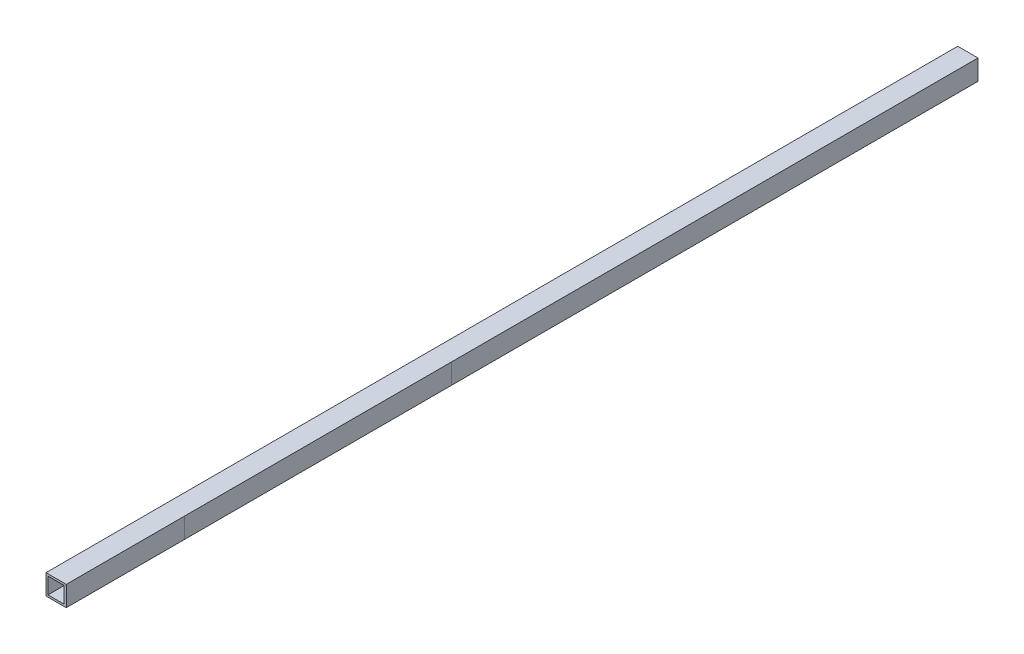
ISO-10303-21;
HEADER;
FILE_DESCRIPTION(('STEP AP214'),'2;1');
FILE_NAME('part.step','',(''),(''),'','','');
FILE_SCHEMA(('AUTOMOTIVE_DESIGN { 1 0 10303 214 1 1 1 1 }'));
ENDSEC;
DATA;
#1=APPLICATION_CONTEXT('core data for automotive mechanical design processes');
#2=APPLICATION_PROTOCOL_DEFINITION('international standard','automotive_design',2000,#1);
#3=PRODUCT_CONTEXT('',#1,'mechanical');
#4=PRODUCT('Part','Part','',(#3));
#5=PRODUCT_RELATED_PRODUCT_CATEGORY('part','',(#4));
#6=PRODUCT_DEFINITION_FORMATION('','',#4);
#7=PRODUCT_DEFINITION_CONTEXT('part definition',#1,'design');
#8=PRODUCT_DEFINITION('design','',#6,#7);
#9=PRODUCT_DEFINITION_SHAPE('','',#8);
#10=(LENGTH_UNIT() NAMED_UNIT(*) SI_UNIT(.MILLI.,.METRE.));
#11=(NAMED_UNIT(*) PLANE_ANGLE_UNIT() SI_UNIT($,.RADIAN.));
#12=(NAMED_UNIT(*) SI_UNIT($,.STERADIAN.) SOLID_ANGLE_UNIT());
#13=UNCERTAINTY_MEASURE_WITH_UNIT(LENGTH_MEASURE(1.E-05),#10,'distance_accuracy_value','');
#14=(GEOMETRIC_REPRESENTATION_CONTEXT(3) GLOBAL_UNCERTAINTY_ASSIGNED_CONTEXT((#13)) GLOBAL_UNIT_ASSIGNED_CONTEXT((#10,
#11,#12)) REPRESENTATION_CONTEXT('',''));
#15=CARTESIAN_POINT('',(0.,0.,0.));
#16=DIRECTION('',(0.,0.,1.));
#17=DIRECTION('',(1.,0.,0.));
#18=AXIS2_PLACEMENT_3D('',#15,#16,#17);
#19=CARTESIAN_POINT('',(40.,0.,-1800.));
#20=DIRECTION('',(1.,0.,0.));
#21=DIRECTION('',(0.,1.,0.));
#22=AXIS2_PLACEMENT_3D('',#19,#20,#21);
#23=PLANE('',#22);
#24=DIRECTION('',(0.,0.,1.));
#25=VECTOR('',#24,1.);
#26=CARTESIAN_POINT('',(40.,0.,-1800.));
#27=LINE('',#26,#25);
#28=CARTESIAN_POINT('',(40.,0.,-233.430525183103));
#29=VERTEX_POINT('',#28);
#30=CARTESIAN_POINT('',(40.,0.,0.));
#31=VERTEX_POINT('',#30);
#32=EDGE_CURVE('E193',#29,#31,#27,.T.);
#33=ORIENTED_EDGE('',*,*,#32,.F.);
#34=DIRECTION('',(0.,1.,0.));
#35=VECTOR('',#34,1.);
#36=CARTESIAN_POINT('',(40.,0.,-233.430525183103));
#37=LINE('',#36,#35);
#38=CARTESIAN_POINT('',(40.,40.,-233.430525183103));
#39=VERTEX_POINT('',#38);
#40=EDGE_CURVE('E11',#29,#39,#37,.T.);
#41=ORIENTED_EDGE('',*,*,#40,.T.);
#42=DIRECTION('',(0.,0.,1.));
#43=VECTOR('',#42,1.);
#44=CARTESIAN_POINT('',(40.,40.,-1800.));
#45=LINE('',#44,#43);
#46=CARTESIAN_POINT('',(40.,40.,0.));
#47=VERTEX_POINT('',#46);
#48=EDGE_CURVE('E188',#39,#47,#45,.T.);
#49=ORIENTED_EDGE('',*,*,#48,.T.);
#50=DIRECTION('',(0.,1.,0.));
#51=VECTOR('',#50,1.);
#52=CARTESIAN_POINT('',(40.,0.,0.));
#53=LINE('',#52,#51);
#54=EDGE_CURVE('E177',#31,#47,#53,.T.);
#55=ORIENTED_EDGE('',*,*,#54,.F.);
#56=EDGE_LOOP('',(#33,#41,#49,#55));
#57=FACE_BOUND('',#56,.T.);
#58=ADVANCED_FACE('F39',(#57),#23,.T.);
#59=ORIENTED_EDGE('',*,*,#40,.F.);
#60=CARTESIAN_POINT('',(40.,0.,-760.887215534173));
#61=VERTEX_POINT('',#60);
#62=EDGE_CURVE('E192',#61,#29,#27,.T.);
#63=ORIENTED_EDGE('',*,*,#62,.F.);
#64=DIRECTION('',(0.,1.,0.));
#65=VECTOR('',#64,1.);
#66=CARTESIAN_POINT('',(40.,0.,-760.887215534173));
#67=LINE('',#66,#65);
#68=CARTESIAN_POINT('',(40.,40.,-760.887215534173));
#69=VERTEX_POINT('',#68);
#70=EDGE_CURVE('E48',#61,#69,#67,.T.);
#71=ORIENTED_EDGE('',*,*,#70,.T.);
#72=EDGE_CURVE('E187',#69,#39,#45,.T.);
#73=ORIENTED_EDGE('',*,*,#72,.T.);
#74=EDGE_LOOP('',(#59,#63,#71,#73));
#75=FACE_BOUND('',#74,.T.);
#76=ADVANCED_FACE('F198',(#75),#23,.T.);
#77=CARTESIAN_POINT('',(0.,0.,-1800.));
#78=DIRECTION('',(-1.,0.,0.));
#79=DIRECTION('',(0.,0.,1.));
#80=AXIS2_PLACEMENT_3D('',#77,#78,#79);
#81=PLANE('',#80);
#82=DIRECTION('',(0.,-1.,0.));
#83=VECTOR('',#82,1.);
#84=CARTESIAN_POINT('',(0.,0.,0.));
#85=LINE('',#84,#83);
#86=CARTESIAN_POINT('',(0.,40.,0.));
#87=VERTEX_POINT('',#86);
#88=CARTESIAN_POINT('',(0.,0.,0.));
#89=VERTEX_POINT('',#88);
#90=EDGE_CURVE('E154',#87,#89,#85,.T.);
#91=ORIENTED_EDGE('',*,*,#90,.F.);
#92=DIRECTION('',(0.,0.,1.));
#93=VECTOR('',#92,1.);
#94=CARTESIAN_POINT('',(0.,40.,-1800.));
#95=LINE('',#94,#93);
#96=CARTESIAN_POINT('',(0.,40.,-1800.));
#97=VERTEX_POINT('',#96);
#98=EDGE_CURVE('E182',#97,#87,#95,.T.);
#99=ORIENTED_EDGE('',*,*,#98,.F.);
#100=DIRECTION('',(0.,-1.,0.));
#101=VECTOR('',#100,1.);
#102=CARTESIAN_POINT('',(0.,0.,-1800.));
#103=LINE('',#102,#101);
#104=CARTESIAN_POINT('',(0.,0.,-1800.));
#105=VERTEX_POINT('',#104);
#106=EDGE_CURVE('E158',#97,#105,#103,.T.);
#107=ORIENTED_EDGE('',*,*,#106,.T.);
#108=DIRECTION('',(0.,0.,1.));
#109=VECTOR('',#108,1.);
#110=CARTESIAN_POINT('',(0.,0.,-1800.));
#111=LINE('',#110,#109);
#112=EDGE_CURVE('E171',#105,#89,#111,.T.);
#113=ORIENTED_EDGE('',*,*,#112,.T.);
#114=EDGE_LOOP('',(#91,#99,#107,#113));
#115=FACE_BOUND('',#114,.T.);
#116=ADVANCED_FACE('F41',(#115),#81,.T.);
#117=CARTESIAN_POINT('',(0.,40.,-1800.));
#118=DIRECTION('',(0.,1.,0.));
#119=DIRECTION('',(0.,0.,1.));
#120=AXIS2_PLACEMENT_3D('',#117,#118,#119);
#121=PLANE('',#120);
#122=DIRECTION('',(-1.,0.,0.));
#123=VECTOR('',#122,1.);
#124=CARTESIAN_POINT('',(0.,40.,0.));
#125=LINE('',#124,#123);
#126=EDGE_CURVE('E162',#47,#87,#125,.T.);
#127=ORIENTED_EDGE('',*,*,#126,.F.);
#128=ORIENTED_EDGE('',*,*,#48,.F.);
#129=ORIENTED_EDGE('',*,*,#72,.F.);
#130=CARTESIAN_POINT('',(40.,40.,-1800.));
#131=VERTEX_POINT('',#130);
#132=EDGE_CURVE('E184',#131,#69,#45,.T.);
#133=ORIENTED_EDGE('',*,*,#132,.F.);
#134=DIRECTION('',(-1.,0.,0.));
#135=VECTOR('',#134,1.);
#136=CARTESIAN_POINT('',(0.,40.,-1800.));
#137=LINE('',#136,#135);
#138=EDGE_CURVE('E168',#131,#97,#137,.T.);
#139=ORIENTED_EDGE('',*,*,#138,.T.);
#140=ORIENTED_EDGE('',*,*,#98,.T.);
#141=EDGE_LOOP('',(#127,#128,#129,#133,#139,#140));
#142=FACE_BOUND('',#141,.T.);
#143=ADVANCED_FACE('F203',(#142),#121,.T.);
#144=ORIENTED_EDGE('',*,*,#70,.F.);
#145=CARTESIAN_POINT('',(40.,0.,-1800.));
#146=VERTEX_POINT('',#145);
#147=EDGE_CURVE('E189',#146,#61,#27,.T.);
#148=ORIENTED_EDGE('',*,*,#147,.F.);
#149=DIRECTION('',(0.,1.,0.));
#150=VECTOR('',#149,1.);
#151=CARTESIAN_POINT('',(40.,0.,-1800.));
#152=LINE('',#151,#150);
#153=EDGE_CURVE('E165',#146,#131,#152,.T.);
#154=ORIENTED_EDGE('',*,*,#153,.T.);
#155=ORIENTED_EDGE('',*,*,#132,.T.);
#156=EDGE_LOOP('',(#144,#148,#154,#155));
#157=FACE_BOUND('',#156,.T.);
#158=ADVANCED_FACE('F204',(#157),#23,.T.);
#159=CARTESIAN_POINT('',(0.,0.,-1800.));
#160=DIRECTION('',(0.,-1.,0.));
#161=DIRECTION('',(0.,0.,-1.));
#162=AXIS2_PLACEMENT_3D('',#159,#160,#161);
#163=PLANE('',#162);
#164=DIRECTION('',(1.,0.,0.));
#165=VECTOR('',#164,1.);
#166=CARTESIAN_POINT('',(0.,0.,0.));
#167=LINE('',#166,#165);
#168=EDGE_CURVE('E174',#89,#31,#167,.T.);
#169=ORIENTED_EDGE('',*,*,#168,.F.);
#170=ORIENTED_EDGE('',*,*,#112,.F.);
#171=DIRECTION('',(1.,0.,0.));
#172=VECTOR('',#171,1.);
#173=CARTESIAN_POINT('',(0.,0.,-1800.));
#174=LINE('',#173,#172);
#175=EDGE_CURVE('E161',#105,#146,#174,.T.);
#176=ORIENTED_EDGE('',*,*,#175,.T.);
#177=ORIENTED_EDGE('',*,*,#147,.T.);
#178=ORIENTED_EDGE('',*,*,#62,.T.);
#179=ORIENTED_EDGE('',*,*,#32,.T.);
#180=EDGE_LOOP('',(#169,#170,#176,#177,#178,#179));
#181=FACE_BOUND('',#180,.T.);
#182=ADVANCED_FACE('F216',(#181),#163,.T.);
#183=CARTESIAN_POINT('',(0.,0.,-1800.));
#184=DIRECTION('',(0.,0.,-1.));
#185=DIRECTION('',(-1.,0.,0.));
#186=AXIS2_PLACEMENT_3D('',#183,#184,#185);
#187=PLANE('',#186);
#188=DIRECTION('',(0.,-1.,0.));
#189=VECTOR('',#188,1.);
#190=CARTESIAN_POINT('',(4.,4.,-1800.));
#191=LINE('',#190,#189);
#192=CARTESIAN_POINT('',(4.,36.,-1800.));
#193=VERTEX_POINT('',#192);
#194=CARTESIAN_POINT('',(4.,4.,-1800.));
#195=VERTEX_POINT('',#194);
#196=EDGE_CURVE('E118',#193,#195,#191,.T.);
#197=ORIENTED_EDGE('',*,*,#196,.T.);
#198=DIRECTION('',(1.,0.,0.));
#199=VECTOR('',#198,1.);
#200=CARTESIAN_POINT('',(4.,4.,-1800.));
#201=LINE('',#200,#199);
#202=CARTESIAN_POINT('',(36.,4.,-1800.));
#203=VERTEX_POINT('',#202);
#204=EDGE_CURVE('E130',#195,#203,#201,.T.);
#205=ORIENTED_EDGE('',*,*,#204,.T.);
#206=DIRECTION('',(0.,1.,0.));
#207=VECTOR('',#206,1.);
#208=CARTESIAN_POINT('',(36.,4.,-1800.));
#209=LINE('',#208,#207);
#210=CARTESIAN_POINT('',(36.,36.,-1800.));
#211=VERTEX_POINT('',#210);
#212=EDGE_CURVE('E134',#203,#211,#209,.T.);
#213=ORIENTED_EDGE('',*,*,#212,.T.);
#214=DIRECTION('',(-1.,0.,0.));
#215=VECTOR('',#214,1.);
#216=CARTESIAN_POINT('',(4.,36.,-1800.));
#217=LINE('',#216,#215);
#218=EDGE_CURVE('E126',#211,#193,#217,.T.);
#219=ORIENTED_EDGE('',*,*,#218,.T.);
#220=EDGE_LOOP('',(#197,#205,#213,#219));
#221=FACE_BOUND('',#220,.T.);
#222=ORIENTED_EDGE('',*,*,#106,.F.);
#223=ORIENTED_EDGE('',*,*,#138,.F.);
#224=ORIENTED_EDGE('',*,*,#153,.F.);
#225=ORIENTED_EDGE('',*,*,#175,.F.);
#226=EDGE_LOOP('',(#222,#223,#224,#225));
#227=FACE_BOUND('',#226,.T.);
#228=ADVANCED_FACE('F136',(#221,#227),#187,.T.);
#229=CARTESIAN_POINT('',(0.,0.,0.));
#230=DIRECTION('',(0.,0.,-1.));
#231=DIRECTION('',(-1.,0.,0.));
#232=AXIS2_PLACEMENT_3D('',#229,#230,#231);
#233=PLANE('',#232);
#234=DIRECTION('',(1.,0.,0.));
#235=VECTOR('',#234,1.);
#236=CARTESIAN_POINT('',(4.,4.,0.));
#237=LINE('',#236,#235);
#238=CARTESIAN_POINT('',(4.,4.,0.));
#239=VERTEX_POINT('',#238);
#240=CARTESIAN_POINT('',(36.,4.,0.));
#241=VERTEX_POINT('',#240);
#242=EDGE_CURVE('E148',#239,#241,#237,.T.);
#243=ORIENTED_EDGE('',*,*,#242,.F.);
#244=DIRECTION('',(0.,-1.,0.));
#245=VECTOR('',#244,1.);
#246=CARTESIAN_POINT('',(4.,4.,0.));
#247=LINE('',#246,#245);
#248=CARTESIAN_POINT('',(4.,36.,0.));
#249=VERTEX_POINT('',#248);
#250=EDGE_CURVE('E121',#249,#239,#247,.T.);
#251=ORIENTED_EDGE('',*,*,#250,.F.);
#252=DIRECTION('',(-1.,0.,0.));
#253=VECTOR('',#252,1.);
#254=CARTESIAN_POINT('',(4.,36.,0.));
#255=LINE('',#254,#253);
#256=CARTESIAN_POINT('',(36.,36.,0.));
#257=VERTEX_POINT('',#256);
#258=EDGE_CURVE('E139',#257,#249,#255,.T.);
#259=ORIENTED_EDGE('',*,*,#258,.F.);
#260=DIRECTION('',(0.,1.,0.));
#261=VECTOR('',#260,1.);
#262=CARTESIAN_POINT('',(36.,4.,0.));
#263=LINE('',#262,#261);
#264=EDGE_CURVE('E142',#241,#257,#263,.T.);
#265=ORIENTED_EDGE('',*,*,#264,.F.);
#266=EDGE_LOOP('',(#243,#251,#259,#265));
#267=FACE_BOUND('',#266,.T.);
#268=ORIENTED_EDGE('',*,*,#90,.T.);
#269=ORIENTED_EDGE('',*,*,#168,.T.);
#270=ORIENTED_EDGE('',*,*,#54,.T.);
#271=ORIENTED_EDGE('',*,*,#126,.T.);
#272=EDGE_LOOP('',(#268,#269,#270,#271));
#273=FACE_BOUND('',#272,.T.);
#274=ADVANCED_FACE('F213',(#267,#273),#233,.F.);
#275=CARTESIAN_POINT('',(4.,4.,-1800.));
#276=DIRECTION('',(-1.,0.,0.));
#277=DIRECTION('',(0.,0.,1.));
#278=AXIS2_PLACEMENT_3D('',#275,#276,#277);
#279=PLANE('',#278);
#280=ORIENTED_EDGE('',*,*,#250,.T.);
#281=DIRECTION('',(0.,0.,1.));
#282=VECTOR('',#281,1.);
#283=CARTESIAN_POINT('',(4.,4.,-1800.));
#284=LINE('',#283,#282);
#285=EDGE_CURVE('E114',#195,#239,#284,.T.);
#286=ORIENTED_EDGE('',*,*,#285,.F.);
#287=ORIENTED_EDGE('',*,*,#196,.F.);
#288=DIRECTION('',(0.,0.,1.));
#289=VECTOR('',#288,1.);
#290=CARTESIAN_POINT('',(4.,36.,-1800.));
#291=LINE('',#290,#289);
#292=EDGE_CURVE('E152',#193,#249,#291,.T.);
#293=ORIENTED_EDGE('',*,*,#292,.T.);
#294=EDGE_LOOP('',(#280,#286,#287,#293));
#295=FACE_BOUND('',#294,.T.);
#296=ADVANCED_FACE('F116',(#295),#279,.F.);
#297=CARTESIAN_POINT('',(4.,36.,-1800.));
#298=DIRECTION('',(0.,1.,0.));
#299=DIRECTION('',(0.,0.,1.));
#300=AXIS2_PLACEMENT_3D('',#297,#298,#299);
#301=PLANE('',#300);
#302=ORIENTED_EDGE('',*,*,#258,.T.);
#303=ORIENTED_EDGE('',*,*,#292,.F.);
#304=ORIENTED_EDGE('',*,*,#218,.F.);
#305=DIRECTION('',(0.,0.,1.));
#306=VECTOR('',#305,1.);
#307=CARTESIAN_POINT('',(36.,36.,-1800.));
#308=LINE('',#307,#306);
#309=EDGE_CURVE('E155',#211,#257,#308,.T.);
#310=ORIENTED_EDGE('',*,*,#309,.T.);
#311=EDGE_LOOP('',(#302,#303,#304,#310));
#312=FACE_BOUND('',#311,.T.);
#313=ADVANCED_FACE('F237',(#312),#301,.F.);
#314=CARTESIAN_POINT('',(36.,4.,-1800.));
#315=DIRECTION('',(1.,0.,0.));
#316=DIRECTION('',(0.,0.,-1.));
#317=AXIS2_PLACEMENT_3D('',#314,#315,#316);
#318=PLANE('',#317);
#319=ORIENTED_EDGE('',*,*,#264,.T.);
#320=ORIENTED_EDGE('',*,*,#309,.F.);
#321=ORIENTED_EDGE('',*,*,#212,.F.);
#322=DIRECTION('',(0.,0.,1.));
#323=VECTOR('',#322,1.);
#324=CARTESIAN_POINT('',(36.,4.,-1800.));
#325=LINE('',#324,#323);
#326=EDGE_CURVE('E125',#203,#241,#325,.T.);
#327=ORIENTED_EDGE('',*,*,#326,.T.);
#328=EDGE_LOOP('',(#319,#320,#321,#327));
#329=FACE_BOUND('',#328,.T.);
#330=ADVANCED_FACE('F240',(#329),#318,.F.);
#331=CARTESIAN_POINT('',(4.,4.,-1800.));
#332=DIRECTION('',(0.,-1.,0.));
#333=DIRECTION('',(0.,0.,-1.));
#334=AXIS2_PLACEMENT_3D('',#331,#332,#333);
#335=PLANE('',#334);
#336=ORIENTED_EDGE('',*,*,#242,.T.);
#337=ORIENTED_EDGE('',*,*,#326,.F.);
#338=ORIENTED_EDGE('',*,*,#204,.F.);
#339=ORIENTED_EDGE('',*,*,#285,.T.);
#340=EDGE_LOOP('',(#336,#337,#338,#339));
#341=FACE_BOUND('',#340,.T.);
#342=ADVANCED_FACE('F131',(#341),#335,.F.);
#343=CLOSED_SHELL('',(#58,#76,#116,#143,#158,#182,#228,#274,#296,#313,#330,#342));
#344=MANIFOLD_SOLID_BREP('B2',#343);
#345=ADVANCED_BREP_SHAPE_REPRESENTATION('',(#18,#344),#14);
#346=SHAPE_DEFINITION_REPRESENTATION(#9,#345);
ENDSEC;
END-ISO-10303-21;
